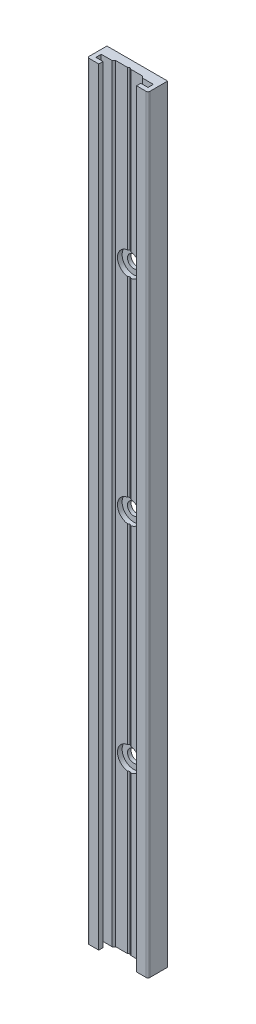
ISO-10303-21;
HEADER;
FILE_DESCRIPTION(('STEP AP214'),'2;1');
FILE_NAME('part.step','',(''),(''),'','','');
FILE_SCHEMA(('AUTOMOTIVE_DESIGN { 1 0 10303 214 1 1 1 1 }'));
ENDSEC;
DATA;
#1=APPLICATION_CONTEXT('core data for automotive mechanical design processes');
#2=APPLICATION_PROTOCOL_DEFINITION('international standard','automotive_design',2000,#1);
#3=PRODUCT_CONTEXT('',#1,'mechanical');
#4=PRODUCT('Part','Part','',(#3));
#5=PRODUCT_RELATED_PRODUCT_CATEGORY('part','',(#4));
#6=PRODUCT_DEFINITION_FORMATION('','',#4);
#7=PRODUCT_DEFINITION_CONTEXT('part definition',#1,'design');
#8=PRODUCT_DEFINITION('design','',#6,#7);
#9=PRODUCT_DEFINITION_SHAPE('','',#8);
#10=(LENGTH_UNIT() NAMED_UNIT(*) SI_UNIT(.MILLI.,.METRE.));
#11=(NAMED_UNIT(*) PLANE_ANGLE_UNIT() SI_UNIT($,.RADIAN.));
#12=(NAMED_UNIT(*) SI_UNIT($,.STERADIAN.) SOLID_ANGLE_UNIT());
#13=UNCERTAINTY_MEASURE_WITH_UNIT(LENGTH_MEASURE(1.E-05),#10,'distance_accuracy_value','');
#14=(GEOMETRIC_REPRESENTATION_CONTEXT(3) GLOBAL_UNCERTAINTY_ASSIGNED_CONTEXT((#13)) GLOBAL_UNIT_ASSIGNED_CONTEXT((#10,
#11,#12)) REPRESENTATION_CONTEXT('',''));
#15=CARTESIAN_POINT('',(0.,0.,0.));
#16=DIRECTION('',(0.,0.,1.));
#17=DIRECTION('',(1.,0.,0.));
#18=AXIS2_PLACEMENT_3D('',#15,#16,#17);
#19=CARTESIAN_POINT('',(8.,215.,5.));
#20=DIRECTION('',(0.,-1.,0.));
#21=DIRECTION('',(0.,0.,-1.));
#22=AXIS2_PLACEMENT_3D('',#19,#20,#21);
#23=CYLINDRICAL_SURFACE('',#22,0.500000000000005);
#24=CARTESIAN_POINT('',(8.,0.,5.));
#25=DIRECTION('',(0.,-1.,0.));
#26=DIRECTION('',(0.,0.,-1.));
#27=AXIS2_PLACEMENT_3D('',#24,#25,#26);
#28=CIRCLE('',#27,0.500000000000005);
#29=CARTESIAN_POINT('',(8.,0.,5.5));
#30=VERTEX_POINT('',#29);
#31=CARTESIAN_POINT('',(8.5,0.,5.));
#32=VERTEX_POINT('',#31);
#33=EDGE_CURVE('E466',#30,#32,#28,.F.);
#34=ORIENTED_EDGE('',*,*,#33,.T.);
#35=DIRECTION('',(0.,-1.,0.));
#36=VECTOR('',#35,1.);
#37=CARTESIAN_POINT('',(8.5,107.5,5.));
#38=LINE('',#37,#36);
#39=CARTESIAN_POINT('',(8.5,215.,5.));
#40=VERTEX_POINT('',#39);
#41=EDGE_CURVE('E393',#40,#32,#38,.T.);
#42=ORIENTED_EDGE('',*,*,#41,.F.);
#43=CARTESIAN_POINT('',(8.,215.,5.));
#44=DIRECTION('',(0.,-1.,0.));
#45=DIRECTION('',(0.,0.,-1.));
#46=AXIS2_PLACEMENT_3D('',#43,#44,#45);
#47=CIRCLE('',#46,0.500000000000005);
#48=CARTESIAN_POINT('',(8.,215.,5.5));
#49=VERTEX_POINT('',#48);
#50=EDGE_CURVE('E20',#40,#49,#47,.T.);
#51=ORIENTED_EDGE('',*,*,#50,.T.);
#52=DIRECTION('',(0.,1.,0.));
#53=VECTOR('',#52,1.);
#54=CARTESIAN_POINT('',(8.,107.5,5.5));
#55=LINE('',#54,#53);
#56=EDGE_CURVE('E386',#30,#49,#55,.T.);
#57=ORIENTED_EDGE('',*,*,#56,.F.);
#58=EDGE_LOOP('',(#34,#42,#51,#57));
#59=FACE_BOUND('',#58,.T.);
#60=ADVANCED_FACE('F16',(#59),#23,.T.);
#61=CARTESIAN_POINT('',(5.3,0.,4.3));
#62=DIRECTION('',(-1.,0.,0.));
#63=DIRECTION('',(0.,0.,1.));
#64=AXIS2_PLACEMENT_3D('',#61,#62,#63);
#65=PLANE('',#64);
#66=DIRECTION('',(0.,0.,1.));
#67=VECTOR('',#66,1.);
#68=CARTESIAN_POINT('',(5.3,0.,4.9));
#69=LINE('',#68,#67);
#70=CARTESIAN_POINT('',(5.3,0.,4.3));
#71=VERTEX_POINT('',#70);
#72=CARTESIAN_POINT('',(5.3,0.,5.5));
#73=VERTEX_POINT('',#72);
#74=EDGE_CURVE('E462',#71,#73,#69,.T.);
#75=ORIENTED_EDGE('',*,*,#74,.T.);
#76=DIRECTION('',(0.,-1.,0.));
#77=VECTOR('',#76,1.);
#78=CARTESIAN_POINT('',(5.3,107.5,5.5));
#79=LINE('',#78,#77);
#80=CARTESIAN_POINT('',(5.3,215.,5.5));
#81=VERTEX_POINT('',#80);
#82=EDGE_CURVE('E389',#81,#73,#79,.T.);
#83=ORIENTED_EDGE('',*,*,#82,.F.);
#84=DIRECTION('',(0.,0.,-1.));
#85=VECTOR('',#84,1.);
#86=CARTESIAN_POINT('',(5.3,215.,4.9));
#87=LINE('',#86,#85);
#88=CARTESIAN_POINT('',(5.3,215.,4.3));
#89=VERTEX_POINT('',#88);
#90=EDGE_CURVE('E153',#81,#89,#87,.T.);
#91=ORIENTED_EDGE('',*,*,#90,.T.);
#92=DIRECTION('',(0.,1.,0.));
#93=VECTOR('',#92,1.);
#94=CARTESIAN_POINT('',(5.3,107.5,4.3));
#95=LINE('',#94,#93);
#96=EDGE_CURVE('E383',#71,#89,#95,.T.);
#97=ORIENTED_EDGE('',*,*,#96,.F.);
#98=EDGE_LOOP('',(#75,#83,#91,#97));
#99=FACE_BOUND('',#98,.T.);
#100=ADVANCED_FACE('F636',(#99),#65,.T.);
#101=CARTESIAN_POINT('',(7.3,0.,2.8));
#102=DIRECTION('',(-1.,0.,0.));
#103=DIRECTION('',(0.,0.,1.));
#104=AXIS2_PLACEMENT_3D('',#101,#102,#103);
#105=PLANE('',#104);
#106=DIRECTION('',(0.,0.,1.));
#107=VECTOR('',#106,1.);
#108=CARTESIAN_POINT('',(7.3,0.,3.55));
#109=LINE('',#108,#107);
#110=CARTESIAN_POINT('',(7.3,0.,2.8));
#111=VERTEX_POINT('',#110);
#112=CARTESIAN_POINT('',(7.3,0.,4.3));
#113=VERTEX_POINT('',#112);
#114=EDGE_CURVE('E448',#111,#113,#109,.T.);
#115=ORIENTED_EDGE('',*,*,#114,.T.);
#116=DIRECTION('',(0.,-1.,0.));
#117=VECTOR('',#116,1.);
#118=CARTESIAN_POINT('',(7.3,107.5,4.3));
#119=LINE('',#118,#117);
#120=CARTESIAN_POINT('',(7.3,215.,4.3));
#121=VERTEX_POINT('',#120);
#122=EDGE_CURVE('E388',#121,#113,#119,.T.);
#123=ORIENTED_EDGE('',*,*,#122,.F.);
#124=DIRECTION('',(0.,0.,-1.));
#125=VECTOR('',#124,1.);
#126=CARTESIAN_POINT('',(7.3,215.,3.55));
#127=LINE('',#126,#125);
#128=CARTESIAN_POINT('',(7.3,215.,2.8));
#129=VERTEX_POINT('',#128);
#130=EDGE_CURVE('E457',#121,#129,#127,.T.);
#131=ORIENTED_EDGE('',*,*,#130,.T.);
#132=DIRECTION('',(0.,1.,0.));
#133=VECTOR('',#132,1.);
#134=CARTESIAN_POINT('',(7.3,107.5,2.8));
#135=LINE('',#134,#133);
#136=EDGE_CURVE('E378',#111,#129,#135,.T.);
#137=ORIENTED_EDGE('',*,*,#136,.F.);
#138=EDGE_LOOP('',(#115,#123,#131,#137));
#139=FACE_BOUND('',#138,.T.);
#140=ADVANCED_FACE('F642',(#139),#105,.T.);
#141=CARTESIAN_POINT('',(-7.3,0.,4.3));
#142=DIRECTION('',(1.,0.,0.));
#143=DIRECTION('',(0.,0.,-1.));
#144=AXIS2_PLACEMENT_3D('',#141,#142,#143);
#145=PLANE('',#144);
#146=DIRECTION('',(0.,0.,-1.));
#147=VECTOR('',#146,1.);
#148=CARTESIAN_POINT('',(-7.3,0.,3.55));
#149=LINE('',#148,#147);
#150=CARTESIAN_POINT('',(-7.3,0.,4.3));
#151=VERTEX_POINT('',#150);
#152=CARTESIAN_POINT('',(-7.3,0.,2.8));
#153=VERTEX_POINT('',#152);
#154=EDGE_CURVE('E442',#151,#153,#149,.T.);
#155=ORIENTED_EDGE('',*,*,#154,.T.);
#156=DIRECTION('',(0.,-1.,0.));
#157=VECTOR('',#156,1.);
#158=CARTESIAN_POINT('',(-7.3,107.5,2.8));
#159=LINE('',#158,#157);
#160=CARTESIAN_POINT('',(-7.3,215.,2.8));
#161=VERTEX_POINT('',#160);
#162=EDGE_CURVE('E382',#161,#153,#159,.T.);
#163=ORIENTED_EDGE('',*,*,#162,.F.);
#164=DIRECTION('',(0.,0.,1.));
#165=VECTOR('',#164,1.);
#166=CARTESIAN_POINT('',(-7.3,215.,3.55));
#167=LINE('',#166,#165);
#168=CARTESIAN_POINT('',(-7.3,215.,4.3));
#169=VERTEX_POINT('',#168);
#170=EDGE_CURVE('E445',#161,#169,#167,.T.);
#171=ORIENTED_EDGE('',*,*,#170,.T.);
#172=DIRECTION('',(0.,1.,0.));
#173=VECTOR('',#172,1.);
#174=CARTESIAN_POINT('',(-7.3,107.5,4.3));
#175=LINE('',#174,#173);
#176=EDGE_CURVE('E351',#151,#169,#175,.T.);
#177=ORIENTED_EDGE('',*,*,#176,.F.);
#178=EDGE_LOOP('',(#155,#163,#171,#177));
#179=FACE_BOUND('',#178,.T.);
#180=ADVANCED_FACE('F679',(#179),#145,.T.);
#181=CARTESIAN_POINT('',(-5.3,0.,5.5));
#182=DIRECTION('',(1.,0.,0.));
#183=DIRECTION('',(0.,0.,-1.));
#184=AXIS2_PLACEMENT_3D('',#181,#182,#183);
#185=PLANE('',#184);
#186=DIRECTION('',(0.,0.,-1.));
#187=VECTOR('',#186,1.);
#188=CARTESIAN_POINT('',(-5.3,0.,4.9));
#189=LINE('',#188,#187);
#190=CARTESIAN_POINT('',(-5.3,0.,5.5));
#191=VERTEX_POINT('',#190);
#192=CARTESIAN_POINT('',(-5.3,0.,4.3));
#193=VERTEX_POINT('',#192);
#194=EDGE_CURVE('E433',#191,#193,#189,.T.);
#195=ORIENTED_EDGE('',*,*,#194,.T.);
#196=DIRECTION('',(0.,-1.,0.));
#197=VECTOR('',#196,1.);
#198=CARTESIAN_POINT('',(-5.3,107.5,4.3));
#199=LINE('',#198,#197);
#200=CARTESIAN_POINT('',(-5.3,215.,4.3));
#201=VERTEX_POINT('',#200);
#202=EDGE_CURVE('E430',#201,#193,#199,.T.);
#203=ORIENTED_EDGE('',*,*,#202,.F.);
#204=DIRECTION('',(0.,0.,1.));
#205=VECTOR('',#204,1.);
#206=CARTESIAN_POINT('',(-5.3,215.,4.9));
#207=LINE('',#206,#205);
#208=CARTESIAN_POINT('',(-5.3,215.,5.5));
#209=VERTEX_POINT('',#208);
#210=EDGE_CURVE('E437',#201,#209,#207,.T.);
#211=ORIENTED_EDGE('',*,*,#210,.T.);
#212=DIRECTION('',(0.,1.,0.));
#213=VECTOR('',#212,1.);
#214=CARTESIAN_POINT('',(-5.3,107.5,5.5));
#215=LINE('',#214,#213);
#216=EDGE_CURVE('E343',#191,#209,#215,.T.);
#217=ORIENTED_EDGE('',*,*,#216,.F.);
#218=EDGE_LOOP('',(#195,#203,#211,#217));
#219=FACE_BOUND('',#218,.T.);
#220=ADVANCED_FACE('F688',(#219),#185,.T.);
#221=CARTESIAN_POINT('',(-8.,215.,5.));
#222=DIRECTION('',(0.,-1.,0.));
#223=DIRECTION('',(0.,0.,-1.));
#224=AXIS2_PLACEMENT_3D('',#221,#222,#223);
#225=CYLINDRICAL_SURFACE('',#224,0.5);
#226=CARTESIAN_POINT('',(-8.,0.,5.));
#227=DIRECTION('',(0.,-1.,0.));
#228=DIRECTION('',(0.,0.,-1.));
#229=AXIS2_PLACEMENT_3D('',#226,#227,#228);
#230=CIRCLE('',#229,0.5);
#231=CARTESIAN_POINT('',(-8.5,0.,5.));
#232=VERTEX_POINT('',#231);
#233=CARTESIAN_POINT('',(-8.,0.,5.5));
#234=VERTEX_POINT('',#233);
#235=EDGE_CURVE('E585',#232,#234,#230,.F.);
#236=ORIENTED_EDGE('',*,*,#235,.T.);
#237=DIRECTION('',(0.,-1.,0.));
#238=VECTOR('',#237,1.);
#239=CARTESIAN_POINT('',(-8.,107.5,5.5));
#240=LINE('',#239,#238);
#241=CARTESIAN_POINT('',(-8.,215.,5.5));
#242=VERTEX_POINT('',#241);
#243=EDGE_CURVE('E348',#242,#234,#240,.T.);
#244=ORIENTED_EDGE('',*,*,#243,.F.);
#245=CARTESIAN_POINT('',(-8.,215.,5.));
#246=DIRECTION('',(0.,-1.,0.));
#247=DIRECTION('',(0.,0.,-1.));
#248=AXIS2_PLACEMENT_3D('',#245,#246,#247);
#249=CIRCLE('',#248,0.5);
#250=CARTESIAN_POINT('',(-8.5,215.,5.));
#251=VERTEX_POINT('',#250);
#252=EDGE_CURVE('E436',#242,#251,#249,.T.);
#253=ORIENTED_EDGE('',*,*,#252,.T.);
#254=DIRECTION('',(0.,1.,0.));
#255=VECTOR('',#254,1.);
#256=CARTESIAN_POINT('',(-8.5,107.5,5.));
#257=LINE('',#256,#255);
#258=EDGE_CURVE('E339',#232,#251,#257,.T.);
#259=ORIENTED_EDGE('',*,*,#258,.F.);
#260=EDGE_LOOP('',(#236,#244,#253,#259));
#261=FACE_BOUND('',#260,.T.);
#262=ADVANCED_FACE('F696',(#261),#225,.T.);
#263=CARTESIAN_POINT('',(0.,167.5,0.));
#264=DIRECTION('',(0.,0.,1.));
#265=DIRECTION('',(1.,0.,0.));
#266=AXIS2_PLACEMENT_3D('',#263,#264,#265);
#267=CYLINDRICAL_SURFACE('',#266,1.75);
#268=CARTESIAN_POINT('',(0.,167.5,0.));
#269=DIRECTION('',(0.,0.,1.));
#270=DIRECTION('',(1.,0.,0.));
#271=AXIS2_PLACEMENT_3D('',#268,#269,#270);
#272=CIRCLE('',#271,1.75);
#273=CARTESIAN_POINT('',(1.75,167.5,0.));
#274=VERTEX_POINT('',#273);
#275=EDGE_CURVE('E403',#274,#274,#272,.T.);
#276=ORIENTED_EDGE('',*,*,#275,.F.);
#277=EDGE_LOOP('',(#276));
#278=FACE_BOUND('',#277,.T.);
#279=CARTESIAN_POINT('',(0.,167.5,1.));
#280=DIRECTION('',(0.,0.,1.));
#281=DIRECTION('',(1.,0.,0.));
#282=AXIS2_PLACEMENT_3D('',#279,#280,#281);
#283=CIRCLE('',#282,1.75);
#284=CARTESIAN_POINT('',(1.75,167.5,1.));
#285=VERTEX_POINT('',#284);
#286=EDGE_CURVE('E398',#285,#285,#283,.F.);
#287=ORIENTED_EDGE('',*,*,#286,.F.);
#288=EDGE_LOOP('',(#287));
#289=FACE_BOUND('',#288,.T.);
#290=ADVANCED_FACE('F996',(#278,#289),#267,.F.);
#291=CARTESIAN_POINT('',(0.,107.5,0.));
#292=DIRECTION('',(0.,0.,1.));
#293=DIRECTION('',(1.,0.,0.));
#294=AXIS2_PLACEMENT_3D('',#291,#292,#293);
#295=CYLINDRICAL_SURFACE('',#294,1.75);
#296=CARTESIAN_POINT('',(0.,107.5,0.));
#297=DIRECTION('',(0.,0.,1.));
#298=DIRECTION('',(1.,0.,0.));
#299=AXIS2_PLACEMENT_3D('',#296,#297,#298);
#300=CIRCLE('',#299,1.75);
#301=CARTESIAN_POINT('',(1.75,107.5,0.));
#302=VERTEX_POINT('',#301);
#303=EDGE_CURVE('E572',#302,#302,#300,.T.);
#304=ORIENTED_EDGE('',*,*,#303,.F.);
#305=EDGE_LOOP('',(#304));
#306=FACE_BOUND('',#305,.T.);
#307=CARTESIAN_POINT('',(0.,107.5,1.));
#308=DIRECTION('',(0.,0.,1.));
#309=DIRECTION('',(1.,0.,0.));
#310=AXIS2_PLACEMENT_3D('',#307,#308,#309);
#311=CIRCLE('',#310,1.75);
#312=CARTESIAN_POINT('',(1.75,107.5,1.));
#313=VERTEX_POINT('',#312);
#314=EDGE_CURVE('E342',#313,#313,#311,.F.);
#315=ORIENTED_EDGE('',*,*,#314,.F.);
#316=EDGE_LOOP('',(#315));
#317=FACE_BOUND('',#316,.T.);
#318=ADVANCED_FACE('F986',(#306,#317),#295,.F.);
#319=CARTESIAN_POINT('',(-3.25,164.25,1.));
#320=DIRECTION('',(0.,0.,1.));
#321=DIRECTION('',(1.,0.,0.));
#322=AXIS2_PLACEMENT_3D('',#319,#320,#321);
#323=PLANE('',#322);
#324=ORIENTED_EDGE('',*,*,#286,.T.);
#325=EDGE_LOOP('',(#324));
#326=FACE_BOUND('',#325,.T.);
#327=CARTESIAN_POINT('',(0.,167.5,1.));
#328=DIRECTION('',(0.,0.,1.));
#329=DIRECTION('',(1.,0.,0.));
#330=AXIS2_PLACEMENT_3D('',#327,#328,#329);
#331=CIRCLE('',#330,3.25);
#332=CARTESIAN_POINT('',(3.25,167.5,1.));
#333=VERTEX_POINT('',#332);
#334=EDGE_CURVE('E562',#333,#333,#331,.F.);
#335=ORIENTED_EDGE('',*,*,#334,.F.);
#336=EDGE_LOOP('',(#335));
#337=FACE_BOUND('',#336,.T.);
#338=ADVANCED_FACE('F978',(#326,#337),#323,.T.);
#339=CARTESIAN_POINT('',(8.5,0.,5.));
#340=DIRECTION('',(1.,0.,0.));
#341=DIRECTION('',(0.,0.,-1.));
#342=AXIS2_PLACEMENT_3D('',#339,#340,#341);
#343=PLANE('',#342);
#344=DIRECTION('',(0.,0.,1.));
#345=VECTOR('',#344,1.);
#346=CARTESIAN_POINT('',(8.5,0.,2.75));
#347=LINE('',#346,#345);
#348=CARTESIAN_POINT('',(8.5,0.,0.));
#349=VERTEX_POINT('',#348);
#350=EDGE_CURVE('E284',#349,#32,#347,.T.);
#351=ORIENTED_EDGE('',*,*,#350,.F.);
#352=DIRECTION('',(0.,-1.,0.));
#353=VECTOR('',#352,1.);
#354=CARTESIAN_POINT('',(8.5,107.5,0.));
#355=LINE('',#354,#353);
#356=CARTESIAN_POINT('',(8.5,215.,0.));
#357=VERTEX_POINT('',#356);
#358=EDGE_CURVE('E404',#357,#349,#355,.T.);
#359=ORIENTED_EDGE('',*,*,#358,.F.);
#360=DIRECTION('',(0.,0.,-1.));
#361=VECTOR('',#360,1.);
#362=CARTESIAN_POINT('',(8.5,215.,2.75));
#363=LINE('',#362,#361);
#364=EDGE_CURVE('E300',#40,#357,#363,.T.);
#365=ORIENTED_EDGE('',*,*,#364,.F.);
#366=ORIENTED_EDGE('',*,*,#41,.T.);
#367=EDGE_LOOP('',(#351,#359,#365,#366));
#368=FACE_BOUND('',#367,.T.);
#369=ADVANCED_FACE('F592',(#368),#343,.T.);
#370=CARTESIAN_POINT('',(5.3,0.,5.5));
#371=DIRECTION('',(0.,0.,1.));
#372=DIRECTION('',(1.,0.,0.));
#373=AXIS2_PLACEMENT_3D('',#370,#371,#372);
#374=PLANE('',#373);
#375=DIRECTION('',(-1.,0.,0.));
#376=VECTOR('',#375,1.);
#377=CARTESIAN_POINT('',(0.,0.,5.5));
#378=LINE('',#377,#376);
#379=EDGE_CURVE('E280',#30,#73,#378,.T.);
#380=ORIENTED_EDGE('',*,*,#379,.F.);
#381=ORIENTED_EDGE('',*,*,#56,.T.);
#382=DIRECTION('',(1.,0.,0.));
#383=VECTOR('',#382,1.);
#384=CARTESIAN_POINT('',(0.,215.,5.5));
#385=LINE('',#384,#383);
#386=EDGE_CURVE('E308',#81,#49,#385,.T.);
#387=ORIENTED_EDGE('',*,*,#386,.F.);
#388=ORIENTED_EDGE('',*,*,#82,.T.);
#389=EDGE_LOOP('',(#380,#381,#387,#388));
#390=FACE_BOUND('',#389,.T.);
#391=ADVANCED_FACE('F960',(#390),#374,.T.);
#392=CARTESIAN_POINT('',(7.3,0.,4.3));
#393=DIRECTION('',(0.,0.,-1.));
#394=DIRECTION('',(-1.,0.,0.));
#395=AXIS2_PLACEMENT_3D('',#392,#393,#394);
#396=PLANE('',#395);
#397=DIRECTION('',(1.,0.,0.));
#398=VECTOR('',#397,1.);
#399=CARTESIAN_POINT('',(0.,0.,4.3));
#400=LINE('',#399,#398);
#401=EDGE_CURVE('E283',#71,#113,#400,.T.);
#402=ORIENTED_EDGE('',*,*,#401,.F.);
#403=ORIENTED_EDGE('',*,*,#96,.T.);
#404=DIRECTION('',(-1.,0.,0.));
#405=VECTOR('',#404,1.);
#406=CARTESIAN_POINT('',(0.,215.,4.3));
#407=LINE('',#406,#405);
#408=EDGE_CURVE('E312',#121,#89,#407,.T.);
#409=ORIENTED_EDGE('',*,*,#408,.F.);
#410=ORIENTED_EDGE('',*,*,#122,.T.);
#411=EDGE_LOOP('',(#402,#403,#409,#410));
#412=FACE_BOUND('',#411,.T.);
#413=ADVANCED_FACE('F639',(#412),#396,.T.);
#414=CARTESIAN_POINT('',(4.25,0.,2.8));
#415=DIRECTION('',(0.,0.,1.));
#416=DIRECTION('',(1.,0.,0.));
#417=AXIS2_PLACEMENT_3D('',#414,#415,#416);
#418=PLANE('',#417);
#419=DIRECTION('',(-1.,0.,0.));
#420=VECTOR('',#419,1.);
#421=CARTESIAN_POINT('',(0.,0.,2.8));
#422=LINE('',#421,#420);
#423=CARTESIAN_POINT('',(4.25,0.,2.8));
#424=VERTEX_POINT('',#423);
#425=EDGE_CURVE('E372',#111,#424,#422,.T.);
#426=ORIENTED_EDGE('',*,*,#425,.F.);
#427=ORIENTED_EDGE('',*,*,#136,.T.);
#428=DIRECTION('',(1.,0.,0.));
#429=VECTOR('',#428,1.);
#430=CARTESIAN_POINT('',(0.,215.,2.8));
#431=LINE('',#430,#429);
#432=CARTESIAN_POINT('',(4.25,215.,2.8));
#433=VERTEX_POINT('',#432);
#434=EDGE_CURVE('E421',#433,#129,#431,.T.);
#435=ORIENTED_EDGE('',*,*,#434,.F.);
#436=DIRECTION('',(0.,1.,0.));
#437=VECTOR('',#436,1.);
#438=CARTESIAN_POINT('',(4.25,107.5,2.8));
#439=LINE('',#438,#437);
#440=EDGE_CURVE('E367',#424,#433,#439,.T.);
#441=ORIENTED_EDGE('',*,*,#440,.F.);
#442=EDGE_LOOP('',(#426,#427,#435,#441));
#443=FACE_BOUND('',#442,.T.);
#444=ADVANCED_FACE('F649',(#443),#418,.T.);
#445=CARTESIAN_POINT('',(-7.3,0.,2.8));
#446=DIRECTION('',(0.,0.,1.));
#447=DIRECTION('',(1.,0.,0.));
#448=AXIS2_PLACEMENT_3D('',#445,#446,#447);
#449=PLANE('',#448);
#450=DIRECTION('',(-1.,0.,0.));
#451=VECTOR('',#450,1.);
#452=CARTESIAN_POINT('',(0.,0.,2.8));
#453=LINE('',#452,#451);
#454=CARTESIAN_POINT('',(-4.25,0.,2.8));
#455=VERTEX_POINT('',#454);
#456=EDGE_CURVE('E361',#455,#153,#453,.T.);
#457=ORIENTED_EDGE('',*,*,#456,.F.);
#458=DIRECTION('',(0.,-1.,0.));
#459=VECTOR('',#458,1.);
#460=CARTESIAN_POINT('',(-4.25,107.5,2.8));
#461=LINE('',#460,#459);
#462=CARTESIAN_POINT('',(-4.25,215.,2.8));
#463=VERTEX_POINT('',#462);
#464=EDGE_CURVE('E299',#463,#455,#461,.T.);
#465=ORIENTED_EDGE('',*,*,#464,.F.);
#466=DIRECTION('',(1.,0.,0.));
#467=VECTOR('',#466,1.);
#468=CARTESIAN_POINT('',(0.,215.,2.8));
#469=LINE('',#468,#467);
#470=EDGE_CURVE('E412',#161,#463,#469,.T.);
#471=ORIENTED_EDGE('',*,*,#470,.F.);
#472=ORIENTED_EDGE('',*,*,#162,.T.);
#473=EDGE_LOOP('',(#457,#465,#471,#472));
#474=FACE_BOUND('',#473,.T.);
#475=ADVANCED_FACE('F676',(#474),#449,.T.);
#476=CARTESIAN_POINT('',(-5.3,0.,4.3));
#477=DIRECTION('',(0.,0.,-1.));
#478=DIRECTION('',(-1.,0.,0.));
#479=AXIS2_PLACEMENT_3D('',#476,#477,#478);
#480=PLANE('',#479);
#481=DIRECTION('',(1.,0.,0.));
#482=VECTOR('',#481,1.);
#483=CARTESIAN_POINT('',(0.,0.,4.3));
#484=LINE('',#483,#482);
#485=EDGE_CURVE('E277',#151,#193,#484,.T.);
#486=ORIENTED_EDGE('',*,*,#485,.F.);
#487=ORIENTED_EDGE('',*,*,#176,.T.);
#488=DIRECTION('',(-1.,0.,0.));
#489=VECTOR('',#488,1.);
#490=CARTESIAN_POINT('',(0.,215.,4.3));
#491=LINE('',#490,#489);
#492=EDGE_CURVE('E318',#201,#169,#491,.T.);
#493=ORIENTED_EDGE('',*,*,#492,.F.);
#494=ORIENTED_EDGE('',*,*,#202,.T.);
#495=EDGE_LOOP('',(#486,#487,#493,#494));
#496=FACE_BOUND('',#495,.T.);
#497=ADVANCED_FACE('F684',(#496),#480,.T.);
#498=CARTESIAN_POINT('',(-8.,0.,5.5));
#499=DIRECTION('',(0.,0.,1.));
#500=DIRECTION('',(1.,0.,0.));
#501=AXIS2_PLACEMENT_3D('',#498,#499,#500);
#502=PLANE('',#501);
#503=DIRECTION('',(-1.,0.,0.));
#504=VECTOR('',#503,1.);
#505=CARTESIAN_POINT('',(0.,0.,5.5));
#506=LINE('',#505,#504);
#507=EDGE_CURVE('E272',#191,#234,#506,.T.);
#508=ORIENTED_EDGE('',*,*,#507,.F.);
#509=ORIENTED_EDGE('',*,*,#216,.T.);
#510=DIRECTION('',(1.,0.,0.));
#511=VECTOR('',#510,1.);
#512=CARTESIAN_POINT('',(0.,215.,5.5));
#513=LINE('',#512,#511);
#514=EDGE_CURVE('E315',#242,#209,#513,.T.);
#515=ORIENTED_EDGE('',*,*,#514,.F.);
#516=ORIENTED_EDGE('',*,*,#243,.T.);
#517=EDGE_LOOP('',(#508,#509,#515,#516));
#518=FACE_BOUND('',#517,.T.);
#519=ADVANCED_FACE('F692',(#518),#502,.T.);
#520=CARTESIAN_POINT('',(-8.5,0.,0.));
#521=DIRECTION('',(-1.,0.,0.));
#522=DIRECTION('',(0.,0.,1.));
#523=AXIS2_PLACEMENT_3D('',#520,#521,#522);
#524=PLANE('',#523);
#525=DIRECTION('',(0.,0.,-1.));
#526=VECTOR('',#525,1.);
#527=CARTESIAN_POINT('',(-8.5,0.,2.75));
#528=LINE('',#527,#526);
#529=CARTESIAN_POINT('',(-8.5,0.,0.));
#530=VERTEX_POINT('',#529);
#531=EDGE_CURVE('E262',#232,#530,#528,.T.);
#532=ORIENTED_EDGE('',*,*,#531,.F.);
#533=ORIENTED_EDGE('',*,*,#258,.T.);
#534=DIRECTION('',(0.,0.,1.));
#535=VECTOR('',#534,1.);
#536=CARTESIAN_POINT('',(-8.5,215.,2.75));
#537=LINE('',#536,#535);
#538=CARTESIAN_POINT('',(-8.5,215.,0.));
#539=VERTEX_POINT('',#538);
#540=EDGE_CURVE('E319',#539,#251,#537,.T.);
#541=ORIENTED_EDGE('',*,*,#540,.F.);
#542=DIRECTION('',(0.,1.,0.));
#543=VECTOR('',#542,1.);
#544=CARTESIAN_POINT('',(-8.5,107.5,0.));
#545=LINE('',#544,#543);
#546=EDGE_CURVE('E399',#530,#539,#545,.T.);
#547=ORIENTED_EDGE('',*,*,#546,.F.);
#548=EDGE_LOOP('',(#532,#533,#541,#547));
#549=FACE_BOUND('',#548,.T.);
#550=ADVANCED_FACE('F697',(#549),#524,.T.);
#551=CARTESIAN_POINT('',(-3.25,104.25,1.));
#552=DIRECTION('',(0.,0.,1.));
#553=DIRECTION('',(1.,0.,0.));
#554=AXIS2_PLACEMENT_3D('',#551,#552,#553);
#555=PLANE('',#554);
#556=ORIENTED_EDGE('',*,*,#314,.T.);
#557=EDGE_LOOP('',(#556));
#558=FACE_BOUND('',#557,.T.);
#559=CARTESIAN_POINT('',(0.,107.5,1.));
#560=DIRECTION('',(0.,0.,1.));
#561=DIRECTION('',(1.,0.,0.));
#562=AXIS2_PLACEMENT_3D('',#559,#560,#561);
#563=CIRCLE('',#562,3.25);
#564=CARTESIAN_POINT('',(3.25,107.5,1.));
#565=VERTEX_POINT('',#564);
#566=EDGE_CURVE('E538',#565,#565,#563,.F.);
#567=ORIENTED_EDGE('',*,*,#566,.F.);
#568=EDGE_LOOP('',(#567));
#569=FACE_BOUND('',#568,.T.);
#570=ADVANCED_FACE('F699',(#558,#569),#555,.T.);
#571=CARTESIAN_POINT('',(8.5,0.,0.));
#572=DIRECTION('',(0.,0.,-1.));
#573=DIRECTION('',(-1.,0.,0.));
#574=AXIS2_PLACEMENT_3D('',#571,#572,#573);
#575=PLANE('',#574);
#576=CARTESIAN_POINT('',(0.,47.5,0.));
#577=DIRECTION('',(0.,0.,1.));
#578=DIRECTION('',(1.,0.,0.));
#579=AXIS2_PLACEMENT_3D('',#576,#577,#578);
#580=CIRCLE('',#579,1.75);
#581=CARTESIAN_POINT('',(1.75000000000001,47.5,0.));
#582=VERTEX_POINT('',#581);
#583=EDGE_CURVE('E524',#582,#582,#580,.F.);
#584=ORIENTED_EDGE('',*,*,#583,.F.);
#585=EDGE_LOOP('',(#584));
#586=FACE_BOUND('',#585,.T.);
#587=ORIENTED_EDGE('',*,*,#303,.T.);
#588=EDGE_LOOP('',(#587));
#589=FACE_BOUND('',#588,.T.);
#590=ORIENTED_EDGE('',*,*,#275,.T.);
#591=EDGE_LOOP('',(#590));
#592=FACE_BOUND('',#591,.T.);
#593=DIRECTION('',(1.,0.,0.));
#594=VECTOR('',#593,1.);
#595=CARTESIAN_POINT('',(0.,0.,0.));
#596=LINE('',#595,#594);
#597=EDGE_CURVE('E289',#530,#349,#596,.T.);
#598=ORIENTED_EDGE('',*,*,#597,.F.);
#599=ORIENTED_EDGE('',*,*,#546,.T.);
#600=DIRECTION('',(-1.,0.,0.));
#601=VECTOR('',#600,1.);
#602=CARTESIAN_POINT('',(0.,215.,0.));
#603=LINE('',#602,#601);
#604=EDGE_CURVE('E324',#357,#539,#603,.T.);
#605=ORIENTED_EDGE('',*,*,#604,.F.);
#606=ORIENTED_EDGE('',*,*,#358,.T.);
#607=EDGE_LOOP('',(#598,#599,#605,#606));
#608=FACE_BOUND('',#607,.T.);
#609=ADVANCED_FACE('F599',(#586,#589,#592,#608),#575,.T.);
#610=CARTESIAN_POINT('',(0.,110.711308144666,2.01132487));
#611=DIRECTION('',(-0.499999994031163,0.,0.866025407230548));
#612=DIRECTION('',(0.866025407230548,0.,0.499999994031163));
#613=AXIS2_PLACEMENT_3D('',#610,#611,#612);
#614=PLANE('',#613);
#615=CARTESIAN_POINT('',(0.,107.5,2.01132487));
#616=DIRECTION('',(-0.499999994031163,0.,0.866025407230548));
#617=DIRECTION('',(0.866025407230548,0.,0.499999994031163));
#618=AXIS2_PLACEMENT_3D('',#615,#616,#617);
#619=ELLIPSE('',#618,3.75277673479943,3.25);
#620=CARTESIAN_POINT('',(0.5,110.711308144666,2.3));
#621=VERTEX_POINT('',#620);
#622=CARTESIAN_POINT('',(0.,110.75,2.01132487));
#623=VERTEX_POINT('',#622);
#624=EDGE_CURVE('E542',#621,#623,#619,.T.);
#625=ORIENTED_EDGE('',*,*,#624,.F.);
#626=DIRECTION('',(0.,-1.,0.));
#627=VECTOR('',#626,1.);
#628=CARTESIAN_POINT('',(0.5,107.5,2.3));
#629=LINE('',#628,#627);
#630=CARTESIAN_POINT('',(0.5,164.288691855334,2.3));
#631=VERTEX_POINT('',#630);
#632=EDGE_CURVE('E245',#631,#621,#629,.T.);
#633=ORIENTED_EDGE('',*,*,#632,.F.);
#634=CARTESIAN_POINT('',(0.,167.5,2.01132487));
#635=DIRECTION('',(-0.499999994031163,0.,0.866025407230548));
#636=DIRECTION('',(0.866025407230548,0.,0.499999994031163));
#637=AXIS2_PLACEMENT_3D('',#634,#635,#636);
#638=ELLIPSE('',#637,3.75277673479943,3.25);
#639=CARTESIAN_POINT('',(0.,164.25,2.01132487));
#640=VERTEX_POINT('',#639);
#641=EDGE_CURVE('E370',#640,#631,#638,.T.);
#642=ORIENTED_EDGE('',*,*,#641,.F.);
#643=DIRECTION('',(0.,1.,0.));
#644=VECTOR('',#643,1.);
#645=CARTESIAN_POINT('',(0.,137.5,2.01132487));
#646=LINE('',#645,#644);
#647=EDGE_CURVE('E250',#623,#640,#646,.T.);
#648=ORIENTED_EDGE('',*,*,#647,.F.);
#649=EDGE_LOOP('',(#625,#633,#642,#648));
#650=FACE_BOUND('',#649,.T.);
#651=ADVANCED_FACE('F725',(#650),#614,.T.);
#652=CARTESIAN_POINT('',(0.,50.7113081446663,2.01132487));
#653=DIRECTION('',(-0.499999994031163,0.,0.866025407230548));
#654=DIRECTION('',(0.866025407230548,0.,0.499999994031163));
#655=AXIS2_PLACEMENT_3D('',#652,#653,#654);
#656=PLANE('',#655);
#657=CARTESIAN_POINT('',(0.,47.5,2.01132487));
#658=DIRECTION('',(-0.499999994031163,0.,0.866025407230548));
#659=DIRECTION('',(0.866025407230548,0.,0.499999994031163));
#660=AXIS2_PLACEMENT_3D('',#657,#658,#659);
#661=ELLIPSE('',#660,3.75277673479943,3.25);
#662=CARTESIAN_POINT('',(0.,50.75,2.01132487));
#663=VERTEX_POINT('',#662);
#664=CARTESIAN_POINT('',(0.5,50.7113081446663,2.3));
#665=VERTEX_POINT('',#664);
#666=EDGE_CURVE('E371',#663,#665,#661,.F.);
#667=ORIENTED_EDGE('',*,*,#666,.T.);
#668=DIRECTION('',(0.,-1.,0.));
#669=VECTOR('',#668,1.);
#670=CARTESIAN_POINT('',(0.5,107.5,2.3));
#671=LINE('',#670,#669);
#672=CARTESIAN_POINT('',(0.5,104.288691855334,2.3));
#673=VERTEX_POINT('',#672);
#674=EDGE_CURVE('E240',#673,#665,#671,.T.);
#675=ORIENTED_EDGE('',*,*,#674,.F.);
#676=CARTESIAN_POINT('',(0.,107.5,2.01132487));
#677=DIRECTION('',(-0.499999994031163,0.,0.866025407230548));
#678=DIRECTION('',(0.866025407230548,0.,0.499999994031163));
#679=AXIS2_PLACEMENT_3D('',#676,#677,#678);
#680=ELLIPSE('',#679,3.75277673479943,3.25);
#681=CARTESIAN_POINT('',(0.,104.25,2.01132487));
#682=VERTEX_POINT('',#681);
#683=EDGE_CURVE('E210',#682,#673,#680,.T.);
#684=ORIENTED_EDGE('',*,*,#683,.F.);
#685=DIRECTION('',(0.,1.,0.));
#686=VECTOR('',#685,1.);
#687=CARTESIAN_POINT('',(0.,77.5,2.01132487));
#688=LINE('',#687,#686);
#689=EDGE_CURVE('E207',#663,#682,#688,.T.);
#690=ORIENTED_EDGE('',*,*,#689,.F.);
#691=EDGE_LOOP('',(#667,#675,#684,#690));
#692=FACE_BOUND('',#691,.T.);
#693=ADVANCED_FACE('F719',(#692),#656,.T.);
#694=CARTESIAN_POINT('',(0.,0.,2.01132487));
#695=DIRECTION('',(-0.499999994031163,0.,0.866025407230548));
#696=DIRECTION('',(0.866025407230548,0.,0.499999994031163));
#697=AXIS2_PLACEMENT_3D('',#694,#695,#696);
#698=PLANE('',#697);
#699=DIRECTION('',(-0.866025407230549,0.,-0.499999994031162));
#700=VECTOR('',#699,1.);
#701=CARTESIAN_POINT('',(0.5,0.,2.3));
#702=LINE('',#701,#700);
#703=CARTESIAN_POINT('',(0.500000000000001,0.,2.3));
#704=VERTEX_POINT('',#703);
#705=CARTESIAN_POINT('',(0.,0.,2.01132487));
#706=VERTEX_POINT('',#705);
#707=EDGE_CURVE('E550',#704,#706,#702,.T.);
#708=ORIENTED_EDGE('',*,*,#707,.F.);
#709=DIRECTION('',(0.,-1.,0.));
#710=VECTOR('',#709,1.);
#711=CARTESIAN_POINT('',(0.5,107.5,2.3));
#712=LINE('',#711,#710);
#713=CARTESIAN_POINT('',(0.5,44.2886918553337,2.3));
#714=VERTEX_POINT('',#713);
#715=EDGE_CURVE('E236',#714,#704,#712,.T.);
#716=ORIENTED_EDGE('',*,*,#715,.F.);
#717=CARTESIAN_POINT('',(0.,47.5,2.01132487));
#718=DIRECTION('',(-0.499999994031163,0.,0.866025407230548));
#719=DIRECTION('',(0.866025407230548,0.,0.499999994031163));
#720=AXIS2_PLACEMENT_3D('',#717,#718,#719);
#721=ELLIPSE('',#720,3.75277673479943,3.25);
#722=CARTESIAN_POINT('',(0.,44.25,2.01132487));
#723=VERTEX_POINT('',#722);
#724=EDGE_CURVE('E527',#723,#714,#721,.T.);
#725=ORIENTED_EDGE('',*,*,#724,.F.);
#726=DIRECTION('',(0.,1.,0.));
#727=VECTOR('',#726,1.);
#728=CARTESIAN_POINT('',(0.,22.1443459276669,2.01132487));
#729=LINE('',#728,#727);
#730=EDGE_CURVE('E257',#706,#723,#729,.T.);
#731=ORIENTED_EDGE('',*,*,#730,.F.);
#732=EDGE_LOOP('',(#708,#716,#725,#731));
#733=FACE_BOUND('',#732,.T.);
#734=ADVANCED_FACE('F663',(#733),#698,.T.);
#735=CARTESIAN_POINT('',(3.75,0.,2.3));
#736=DIRECTION('',(-0.707106781186547,0.,0.707106781186548));
#737=DIRECTION('',(0.707106781186548,0.,0.707106781186547));
#738=AXIS2_PLACEMENT_3D('',#735,#736,#737);
#739=PLANE('',#738);
#740=DIRECTION('',(-0.707106781186548,0.,-0.707106781186547));
#741=VECTOR('',#740,1.);
#742=CARTESIAN_POINT('',(4.25,0.,2.8));
#743=LINE('',#742,#741);
#744=CARTESIAN_POINT('',(3.75,0.,2.3));
#745=VERTEX_POINT('',#744);
#746=EDGE_CURVE('E375',#424,#745,#743,.T.);
#747=ORIENTED_EDGE('',*,*,#746,.F.);
#748=ORIENTED_EDGE('',*,*,#440,.T.);
#749=DIRECTION('',(0.707106781186548,0.,0.707106781186547));
#750=VECTOR('',#749,1.);
#751=CARTESIAN_POINT('',(3.75,215.,2.3));
#752=LINE('',#751,#750);
#753=CARTESIAN_POINT('',(3.75,215.,2.3));
#754=VERTEX_POINT('',#753);
#755=EDGE_CURVE('E424',#754,#433,#752,.T.);
#756=ORIENTED_EDGE('',*,*,#755,.F.);
#757=DIRECTION('',(0.,1.,0.));
#758=VECTOR('',#757,1.);
#759=CARTESIAN_POINT('',(3.75,107.5,2.3));
#760=LINE('',#759,#758);
#761=EDGE_CURVE('E333',#745,#754,#760,.T.);
#762=ORIENTED_EDGE('',*,*,#761,.F.);
#763=EDGE_LOOP('',(#747,#748,#756,#762));
#764=FACE_BOUND('',#763,.T.);
#765=ADVANCED_FACE('F652',(#764),#739,.T.);
#766=CARTESIAN_POINT('',(0.,170.711308144666,2.01132487));
#767=DIRECTION('',(-0.499999994031163,0.,0.866025407230548));
#768=DIRECTION('',(0.866025407230548,0.,0.499999994031163));
#769=AXIS2_PLACEMENT_3D('',#766,#767,#768);
#770=PLANE('',#769);
#771=DIRECTION('',(0.866025407230549,0.,0.499999994031162));
#772=VECTOR('',#771,1.);
#773=CARTESIAN_POINT('',(0.,215.,2.01132487));
#774=LINE('',#773,#772);
#775=CARTESIAN_POINT('',(0.,215.,2.01132487));
#776=VERTEX_POINT('',#775);
#777=CARTESIAN_POINT('',(0.500000000000002,215.,2.3));
#778=VERTEX_POINT('',#777);
#779=EDGE_CURVE('E555',#776,#778,#774,.T.);
#780=ORIENTED_EDGE('',*,*,#779,.F.);
#781=DIRECTION('',(0.,1.,0.));
#782=VECTOR('',#781,1.);
#783=CARTESIAN_POINT('',(0.,192.855654072333,2.01132487));
#784=LINE('',#783,#782);
#785=CARTESIAN_POINT('',(0.,170.75,2.01132487));
#786=VERTEX_POINT('',#785);
#787=EDGE_CURVE('E327',#786,#776,#784,.T.);
#788=ORIENTED_EDGE('',*,*,#787,.F.);
#789=CARTESIAN_POINT('',(0.,167.5,2.01132487));
#790=DIRECTION('',(-0.499999994031163,0.,0.866025407230548));
#791=DIRECTION('',(0.866025407230548,0.,0.499999994031163));
#792=AXIS2_PLACEMENT_3D('',#789,#790,#791);
#793=ELLIPSE('',#792,3.75277673479943,3.25);
#794=CARTESIAN_POINT('',(0.5,170.711308144666,2.3));
#795=VERTEX_POINT('',#794);
#796=EDGE_CURVE('E566',#795,#786,#793,.T.);
#797=ORIENTED_EDGE('',*,*,#796,.F.);
#798=DIRECTION('',(0.,-1.,0.));
#799=VECTOR('',#798,1.);
#800=CARTESIAN_POINT('',(0.5,107.5,2.3));
#801=LINE('',#800,#799);
#802=EDGE_CURVE('E231',#778,#795,#801,.T.);
#803=ORIENTED_EDGE('',*,*,#802,.F.);
#804=EDGE_LOOP('',(#780,#788,#797,#803));
#805=FACE_BOUND('',#804,.T.);
#806=ADVANCED_FACE('F735',(#805),#770,.T.);
#807=CARTESIAN_POINT('',(0.,167.5,1.));
#808=DIRECTION('',(0.,0.,1.));
#809=DIRECTION('',(1.,0.,0.));
#810=AXIS2_PLACEMENT_3D('',#807,#808,#809);
#811=CYLINDRICAL_SURFACE('',#810,3.25);
#812=CARTESIAN_POINT('',(0.,167.5,2.3));
#813=DIRECTION('',(0.,0.,1.));
#814=DIRECTION('',(1.,0.,0.));
#815=AXIS2_PLACEMENT_3D('',#812,#813,#814);
#816=CIRCLE('',#815,3.25);
#817=EDGE_CURVE('E249',#795,#631,#816,.F.);
#818=ORIENTED_EDGE('',*,*,#817,.F.);
#819=ORIENTED_EDGE('',*,*,#796,.T.);
#820=CARTESIAN_POINT('',(0.,167.5,2.01132487));
#821=DIRECTION('',(0.499999994031163,0.,0.866025407230548));
#822=DIRECTION('',(-0.866025407230548,0.,0.499999994031163));
#823=AXIS2_PLACEMENT_3D('',#820,#821,#822);
#824=ELLIPSE('',#823,3.75277673479943,3.25);
#825=CARTESIAN_POINT('',(-0.5,170.711308144666,2.3));
#826=VERTEX_POINT('',#825);
#827=EDGE_CURVE('E330',#826,#786,#824,.F.);
#828=ORIENTED_EDGE('',*,*,#827,.F.);
#829=CARTESIAN_POINT('',(0.,167.5,2.3));
#830=DIRECTION('',(0.,0.,1.));
#831=DIRECTION('',(1.,0.,0.));
#832=AXIS2_PLACEMENT_3D('',#829,#830,#831);
#833=CIRCLE('',#832,3.25);
#834=CARTESIAN_POINT('',(-0.5,164.288691855334,2.3));
#835=VERTEX_POINT('',#834);
#836=EDGE_CURVE('E230',#835,#826,#833,.F.);
#837=ORIENTED_EDGE('',*,*,#836,.F.);
#838=CARTESIAN_POINT('',(0.,167.5,2.01132487));
#839=DIRECTION('',(0.499999994031163,0.,0.866025407230548));
#840=DIRECTION('',(-0.866025407230548,0.,0.499999994031163));
#841=AXIS2_PLACEMENT_3D('',#838,#839,#840);
#842=ELLIPSE('',#841,3.75277673479943,3.25);
#843=EDGE_CURVE('E534',#640,#835,#842,.F.);
#844=ORIENTED_EDGE('',*,*,#843,.F.);
#845=ORIENTED_EDGE('',*,*,#641,.T.);
#846=EDGE_LOOP('',(#818,#819,#828,#837,#844,#845));
#847=FACE_BOUND('',#846,.T.);
#848=ORIENTED_EDGE('',*,*,#334,.T.);
#849=EDGE_LOOP('',(#848));
#850=FACE_BOUND('',#849,.T.);
#851=ADVANCED_FACE('F729',(#847,#850),#811,.F.);
#852=CARTESIAN_POINT('',(-0.5,170.711308144666,2.3));
#853=DIRECTION('',(0.499999994031163,0.,0.866025407230548));
#854=DIRECTION('',(0.866025407230548,0.,-0.499999994031163));
#855=AXIS2_PLACEMENT_3D('',#852,#853,#854);
#856=PLANE('',#855);
#857=DIRECTION('',(0.866025407230549,0.,-0.499999994031162));
#858=VECTOR('',#857,1.);
#859=CARTESIAN_POINT('',(-0.5,215.,2.3));
#860=LINE('',#859,#858);
#861=CARTESIAN_POINT('',(-0.500000000000001,215.,2.3));
#862=VERTEX_POINT('',#861);
#863=EDGE_CURVE('E414',#862,#776,#860,.T.);
#864=ORIENTED_EDGE('',*,*,#863,.F.);
#865=DIRECTION('',(0.,1.,0.));
#866=VECTOR('',#865,1.);
#867=CARTESIAN_POINT('',(-0.5,107.5,2.3));
#868=LINE('',#867,#866);
#869=EDGE_CURVE('E225',#826,#862,#868,.T.);
#870=ORIENTED_EDGE('',*,*,#869,.F.);
#871=ORIENTED_EDGE('',*,*,#827,.T.);
#872=ORIENTED_EDGE('',*,*,#787,.T.);
#873=EDGE_LOOP('',(#864,#870,#871,#872));
#874=FACE_BOUND('',#873,.T.);
#875=ADVANCED_FACE('F738',(#874),#856,.T.);
#876=CARTESIAN_POINT('',(8.5,215.,0.));
#877=DIRECTION('',(0.,1.,0.));
#878=DIRECTION('',(-1.,0.,0.));
#879=AXIS2_PLACEMENT_3D('',#876,#877,#878);
#880=PLANE('',#879);
#881=ORIENTED_EDGE('',*,*,#50,.F.);
#882=ORIENTED_EDGE('',*,*,#364,.T.);
#883=ORIENTED_EDGE('',*,*,#604,.T.);
#884=ORIENTED_EDGE('',*,*,#540,.T.);
#885=ORIENTED_EDGE('',*,*,#252,.F.);
#886=ORIENTED_EDGE('',*,*,#514,.T.);
#887=ORIENTED_EDGE('',*,*,#210,.F.);
#888=ORIENTED_EDGE('',*,*,#492,.T.);
#889=ORIENTED_EDGE('',*,*,#170,.F.);
#890=ORIENTED_EDGE('',*,*,#470,.T.);
#891=DIRECTION('',(-0.707106781186548,0.,0.707106781186547));
#892=VECTOR('',#891,1.);
#893=CARTESIAN_POINT('',(-4.,215.,2.55));
#894=LINE('',#893,#892);
#895=CARTESIAN_POINT('',(-3.75,215.,2.3));
#896=VERTEX_POINT('',#895);
#897=EDGE_CURVE('E296',#896,#463,#894,.T.);
#898=ORIENTED_EDGE('',*,*,#897,.F.);
#899=DIRECTION('',(-1.,0.,0.));
#900=VECTOR('',#899,1.);
#901=CARTESIAN_POINT('',(-2.125,215.,2.3));
#902=LINE('',#901,#900);
#903=EDGE_CURVE('E229',#862,#896,#902,.T.);
#904=ORIENTED_EDGE('',*,*,#903,.F.);
#905=ORIENTED_EDGE('',*,*,#863,.T.);
#906=ORIENTED_EDGE('',*,*,#779,.T.);
#907=DIRECTION('',(-1.,0.,0.));
#908=VECTOR('',#907,1.);
#909=CARTESIAN_POINT('',(2.125,215.,2.3));
#910=LINE('',#909,#908);
#911=EDGE_CURVE('E235',#754,#778,#910,.T.);
#912=ORIENTED_EDGE('',*,*,#911,.F.);
#913=ORIENTED_EDGE('',*,*,#755,.T.);
#914=ORIENTED_EDGE('',*,*,#434,.T.);
#915=ORIENTED_EDGE('',*,*,#130,.F.);
#916=ORIENTED_EDGE('',*,*,#408,.T.);
#917=ORIENTED_EDGE('',*,*,#90,.F.);
#918=ORIENTED_EDGE('',*,*,#386,.T.);
#919=EDGE_LOOP('',(#881,#882,#883,#884,#885,#886,#887,#888,#889,#890,#898,#904,#905,#906,#912,
#913,#914,#915,#916,#917,#918));
#920=FACE_BOUND('',#919,.T.);
#921=ADVANCED_FACE('F839',(#920),#880,.T.);
#922=CARTESIAN_POINT('',(-4.25,0.,2.8));
#923=DIRECTION('',(0.707106781186547,0.,0.707106781186548));
#924=DIRECTION('',(0.707106781186548,0.,-0.707106781186547));
#925=AXIS2_PLACEMENT_3D('',#922,#923,#924);
#926=PLANE('',#925);
#927=DIRECTION('',(-0.707106781186548,0.,0.707106781186547));
#928=VECTOR('',#927,1.);
#929=CARTESIAN_POINT('',(-3.75,0.,2.3));
#930=LINE('',#929,#928);
#931=CARTESIAN_POINT('',(-3.75,0.,2.3));
#932=VERTEX_POINT('',#931);
#933=EDGE_CURVE('E364',#932,#455,#930,.T.);
#934=ORIENTED_EDGE('',*,*,#933,.F.);
#935=DIRECTION('',(0.,-1.,0.));
#936=VECTOR('',#935,1.);
#937=CARTESIAN_POINT('',(-3.75,107.5,2.3));
#938=LINE('',#937,#936);
#939=EDGE_CURVE('E267',#896,#932,#938,.T.);
#940=ORIENTED_EDGE('',*,*,#939,.F.);
#941=ORIENTED_EDGE('',*,*,#897,.T.);
#942=ORIENTED_EDGE('',*,*,#464,.T.);
#943=EDGE_LOOP('',(#934,#940,#941,#942));
#944=FACE_BOUND('',#943,.T.);
#945=ADVANCED_FACE('F671',(#944),#926,.T.);
#946=CARTESIAN_POINT('',(-8.5,0.,0.));
#947=DIRECTION('',(0.,-1.,0.));
#948=DIRECTION('',(1.,0.,0.));
#949=AXIS2_PLACEMENT_3D('',#946,#947,#948);
#950=PLANE('',#949);
#951=ORIENTED_EDGE('',*,*,#235,.F.);
#952=ORIENTED_EDGE('',*,*,#531,.T.);
#953=ORIENTED_EDGE('',*,*,#597,.T.);
#954=ORIENTED_EDGE('',*,*,#350,.T.);
#955=ORIENTED_EDGE('',*,*,#33,.F.);
#956=ORIENTED_EDGE('',*,*,#379,.T.);
#957=ORIENTED_EDGE('',*,*,#74,.F.);
#958=ORIENTED_EDGE('',*,*,#401,.T.);
#959=ORIENTED_EDGE('',*,*,#114,.F.);
#960=ORIENTED_EDGE('',*,*,#425,.T.);
#961=ORIENTED_EDGE('',*,*,#746,.T.);
#962=DIRECTION('',(1.,0.,0.));
#963=VECTOR('',#962,1.);
#964=CARTESIAN_POINT('',(2.125,0.,2.3));
#965=LINE('',#964,#963);
#966=EDGE_CURVE('E239',#704,#745,#965,.T.);
#967=ORIENTED_EDGE('',*,*,#966,.F.);
#968=ORIENTED_EDGE('',*,*,#707,.T.);
#969=DIRECTION('',(0.866025407230548,0.,-0.499999994031163));
#970=VECTOR('',#969,1.);
#971=CARTESIAN_POINT('',(-0.25,0.,2.155662435));
#972=LINE('',#971,#970);
#973=CARTESIAN_POINT('',(-0.5,0.,2.3));
#974=VERTEX_POINT('',#973);
#975=EDGE_CURVE('E259',#974,#706,#972,.T.);
#976=ORIENTED_EDGE('',*,*,#975,.F.);
#977=DIRECTION('',(1.,0.,0.));
#978=VECTOR('',#977,1.);
#979=CARTESIAN_POINT('',(-2.125,0.,2.3));
#980=LINE('',#979,#978);
#981=EDGE_CURVE('E219',#932,#974,#980,.T.);
#982=ORIENTED_EDGE('',*,*,#981,.F.);
#983=ORIENTED_EDGE('',*,*,#933,.T.);
#984=ORIENTED_EDGE('',*,*,#456,.T.);
#985=ORIENTED_EDGE('',*,*,#154,.F.);
#986=ORIENTED_EDGE('',*,*,#485,.T.);
#987=ORIENTED_EDGE('',*,*,#194,.F.);
#988=ORIENTED_EDGE('',*,*,#507,.T.);
#989=EDGE_LOOP('',(#951,#952,#953,#954,#955,#956,#957,#958,#959,#960,#961,#967,#968,#976,#982,
#983,#984,#985,#986,#987,#988));
#990=FACE_BOUND('',#989,.T.);
#991=ADVANCED_FACE('F594',(#990),#950,.T.);
#992=CARTESIAN_POINT('',(-0.5,0.,2.3));
#993=DIRECTION('',(0.499999994031163,0.,0.866025407230548));
#994=DIRECTION('',(0.866025407230548,0.,-0.499999994031163));
#995=AXIS2_PLACEMENT_3D('',#992,#993,#994);
#996=PLANE('',#995);
#997=ORIENTED_EDGE('',*,*,#975,.T.);
#998=ORIENTED_EDGE('',*,*,#730,.T.);
#999=CARTESIAN_POINT('',(0.,47.5,2.01132487));
#1000=DIRECTION('',(0.499999994031163,0.,0.866025407230548));
#1001=DIRECTION('',(-0.866025407230548,0.,0.499999994031163));
#1002=AXIS2_PLACEMENT_3D('',#999,#1000,#1001);
#1003=ELLIPSE('',#1002,3.75277673479943,3.25);
#1004=CARTESIAN_POINT('',(-0.5,44.2886918553337,2.3));
#1005=VERTEX_POINT('',#1004);
#1006=EDGE_CURVE('E254',#1005,#723,#1003,.T.);
#1007=ORIENTED_EDGE('',*,*,#1006,.F.);
#1008=DIRECTION('',(0.,1.,0.));
#1009=VECTOR('',#1008,1.);
#1010=CARTESIAN_POINT('',(-0.5,107.5,2.3));
#1011=LINE('',#1010,#1009);
#1012=EDGE_CURVE('E215',#974,#1005,#1011,.T.);
#1013=ORIENTED_EDGE('',*,*,#1012,.F.);
#1014=EDGE_LOOP('',(#997,#998,#1007,#1013));
#1015=FACE_BOUND('',#1014,.T.);
#1016=ADVANCED_FACE('F666',(#1015),#996,.T.);
#1017=CARTESIAN_POINT('',(-0.5,50.7113081446663,2.3));
#1018=DIRECTION('',(0.499999994031163,0.,0.866025407230548));
#1019=DIRECTION('',(0.866025407230548,0.,-0.499999994031163));
#1020=AXIS2_PLACEMENT_3D('',#1017,#1018,#1019);
#1021=PLANE('',#1020);
#1022=CARTESIAN_POINT('',(0.,47.5,2.01132487));
#1023=DIRECTION('',(0.499999994031163,0.,0.866025407230548));
#1024=DIRECTION('',(-0.866025407230548,0.,0.499999994031163));
#1025=AXIS2_PLACEMENT_3D('',#1022,#1023,#1024);
#1026=ELLIPSE('',#1025,3.75277673479943,3.25);
#1027=CARTESIAN_POINT('',(-0.5,50.7113081446663,2.3));
#1028=VERTEX_POINT('',#1027);
#1029=EDGE_CURVE('E35',#1028,#663,#1026,.F.);
#1030=ORIENTED_EDGE('',*,*,#1029,.T.);
#1031=ORIENTED_EDGE('',*,*,#689,.T.);
#1032=CARTESIAN_POINT('',(0.,107.5,2.01132487));
#1033=DIRECTION('',(0.499999994031163,0.,0.866025407230548));
#1034=DIRECTION('',(-0.866025407230548,0.,0.499999994031163));
#1035=AXIS2_PLACEMENT_3D('',#1032,#1033,#1034);
#1036=ELLIPSE('',#1035,3.75277673479943,3.25);
#1037=CARTESIAN_POINT('',(-0.5,104.288691855334,2.3));
#1038=VERTEX_POINT('',#1037);
#1039=EDGE_CURVE('E191',#1038,#682,#1036,.T.);
#1040=ORIENTED_EDGE('',*,*,#1039,.F.);
#1041=DIRECTION('',(0.,1.,0.));
#1042=VECTOR('',#1041,1.);
#1043=CARTESIAN_POINT('',(-0.5,107.5,2.3));
#1044=LINE('',#1043,#1042);
#1045=EDGE_CURVE('E200',#1028,#1038,#1044,.T.);
#1046=ORIENTED_EDGE('',*,*,#1045,.F.);
#1047=EDGE_LOOP('',(#1030,#1031,#1040,#1046));
#1048=FACE_BOUND('',#1047,.T.);
#1049=ADVANCED_FACE('F204',(#1048),#1021,.T.);
#1050=CARTESIAN_POINT('',(0.,107.5,1.));
#1051=DIRECTION('',(0.,0.,1.));
#1052=DIRECTION('',(1.,0.,0.));
#1053=AXIS2_PLACEMENT_3D('',#1050,#1051,#1052);
#1054=CYLINDRICAL_SURFACE('',#1053,3.25);
#1055=CARTESIAN_POINT('',(0.,107.5,2.3));
#1056=DIRECTION('',(0.,0.,1.));
#1057=DIRECTION('',(1.,0.,0.));
#1058=AXIS2_PLACEMENT_3D('',#1055,#1056,#1057);
#1059=CIRCLE('',#1058,3.25);
#1060=EDGE_CURVE('E244',#621,#673,#1059,.F.);
#1061=ORIENTED_EDGE('',*,*,#1060,.F.);
#1062=ORIENTED_EDGE('',*,*,#624,.T.);
#1063=CARTESIAN_POINT('',(0.,107.5,2.01132487));
#1064=DIRECTION('',(0.499999994031163,0.,0.866025407230548));
#1065=DIRECTION('',(-0.866025407230548,0.,0.499999994031163));
#1066=AXIS2_PLACEMENT_3D('',#1063,#1064,#1065);
#1067=ELLIPSE('',#1066,3.75277673479943,3.25);
#1068=CARTESIAN_POINT('',(-0.5,110.711308144666,2.3));
#1069=VERTEX_POINT('',#1068);
#1070=EDGE_CURVE('E193',#1069,#623,#1067,.F.);
#1071=ORIENTED_EDGE('',*,*,#1070,.F.);
#1072=CARTESIAN_POINT('',(0.,107.5,2.3));
#1073=DIRECTION('',(0.,0.,1.));
#1074=DIRECTION('',(1.,0.,0.));
#1075=AXIS2_PLACEMENT_3D('',#1072,#1073,#1074);
#1076=CIRCLE('',#1075,3.25);
#1077=EDGE_CURVE('E187',#1038,#1069,#1076,.F.);
#1078=ORIENTED_EDGE('',*,*,#1077,.F.);
#1079=ORIENTED_EDGE('',*,*,#1039,.T.);
#1080=ORIENTED_EDGE('',*,*,#683,.T.);
#1081=EDGE_LOOP('',(#1061,#1062,#1071,#1078,#1079,#1080));
#1082=FACE_BOUND('',#1081,.T.);
#1083=ORIENTED_EDGE('',*,*,#566,.T.);
#1084=EDGE_LOOP('',(#1083));
#1085=FACE_BOUND('',#1084,.T.);
#1086=ADVANCED_FACE('F189',(#1082,#1085),#1054,.F.);
#1087=CARTESIAN_POINT('',(-0.5,110.711308144666,2.3));
#1088=DIRECTION('',(0.499999994031163,0.,0.866025407230548));
#1089=DIRECTION('',(0.866025407230548,0.,-0.499999994031163));
#1090=AXIS2_PLACEMENT_3D('',#1087,#1088,#1089);
#1091=PLANE('',#1090);
#1092=ORIENTED_EDGE('',*,*,#1070,.T.);
#1093=ORIENTED_EDGE('',*,*,#647,.T.);
#1094=ORIENTED_EDGE('',*,*,#843,.T.);
#1095=DIRECTION('',(0.,1.,0.));
#1096=VECTOR('',#1095,1.);
#1097=CARTESIAN_POINT('',(-0.5,107.5,2.3));
#1098=LINE('',#1097,#1096);
#1099=EDGE_CURVE('E199',#1069,#835,#1098,.T.);
#1100=ORIENTED_EDGE('',*,*,#1099,.F.);
#1101=EDGE_LOOP('',(#1092,#1093,#1094,#1100));
#1102=FACE_BOUND('',#1101,.T.);
#1103=ADVANCED_FACE('F740',(#1102),#1091,.T.);
#1104=CARTESIAN_POINT('',(0.,47.5,0.));
#1105=DIRECTION('',(0.,0.,1.));
#1106=DIRECTION('',(1.,0.,0.));
#1107=AXIS2_PLACEMENT_3D('',#1104,#1105,#1106);
#1108=CYLINDRICAL_SURFACE('',#1107,1.75);
#1109=ORIENTED_EDGE('',*,*,#583,.T.);
#1110=EDGE_LOOP('',(#1109));
#1111=FACE_BOUND('',#1110,.T.);
#1112=CARTESIAN_POINT('',(0.,47.5,1.));
#1113=DIRECTION('',(0.,0.,1.));
#1114=DIRECTION('',(1.,0.,0.));
#1115=AXIS2_PLACEMENT_3D('',#1112,#1113,#1114);
#1116=CIRCLE('',#1115,1.75);
#1117=CARTESIAN_POINT('',(1.75000000000001,47.5,1.));
#1118=VERTEX_POINT('',#1117);
#1119=EDGE_CURVE('E512',#1118,#1118,#1116,.F.);
#1120=ORIENTED_EDGE('',*,*,#1119,.F.);
#1121=EDGE_LOOP('',(#1120));
#1122=FACE_BOUND('',#1121,.T.);
#1123=ADVANCED_FACE('F745',(#1111,#1122),#1108,.F.);
#1124=CARTESIAN_POINT('',(0.5,0.,2.3));
#1125=DIRECTION('',(0.,0.,1.));
#1126=DIRECTION('',(1.,0.,0.));
#1127=AXIS2_PLACEMENT_3D('',#1124,#1125,#1126);
#1128=PLANE('',#1127);
#1129=ORIENTED_EDGE('',*,*,#911,.T.);
#1130=ORIENTED_EDGE('',*,*,#802,.T.);
#1131=ORIENTED_EDGE('',*,*,#817,.T.);
#1132=ORIENTED_EDGE('',*,*,#632,.T.);
#1133=ORIENTED_EDGE('',*,*,#1060,.T.);
#1134=ORIENTED_EDGE('',*,*,#674,.T.);
#1135=CARTESIAN_POINT('',(0.,47.5,2.3));
#1136=DIRECTION('',(0.,0.,1.));
#1137=DIRECTION('',(1.,0.,0.));
#1138=AXIS2_PLACEMENT_3D('',#1135,#1136,#1137);
#1139=CIRCLE('',#1138,3.25);
#1140=EDGE_CURVE('E509',#714,#665,#1139,.T.);
#1141=ORIENTED_EDGE('',*,*,#1140,.F.);
#1142=ORIENTED_EDGE('',*,*,#715,.T.);
#1143=ORIENTED_EDGE('',*,*,#966,.T.);
#1144=ORIENTED_EDGE('',*,*,#761,.T.);
#1145=EDGE_LOOP('',(#1129,#1130,#1131,#1132,#1133,#1134,#1141,#1142,#1143,#1144));
#1146=FACE_BOUND('',#1145,.T.);
#1147=ADVANCED_FACE('F655',(#1146),#1128,.T.);
#1148=CARTESIAN_POINT('',(-3.75,0.,2.3));
#1149=DIRECTION('',(0.,0.,1.));
#1150=DIRECTION('',(1.,0.,0.));
#1151=AXIS2_PLACEMENT_3D('',#1148,#1149,#1150);
#1152=PLANE('',#1151);
#1153=ORIENTED_EDGE('',*,*,#1077,.T.);
#1154=ORIENTED_EDGE('',*,*,#1099,.T.);
#1155=ORIENTED_EDGE('',*,*,#836,.T.);
#1156=ORIENTED_EDGE('',*,*,#869,.T.);
#1157=ORIENTED_EDGE('',*,*,#903,.T.);
#1158=ORIENTED_EDGE('',*,*,#939,.T.);
#1159=ORIENTED_EDGE('',*,*,#981,.T.);
#1160=ORIENTED_EDGE('',*,*,#1012,.T.);
#1161=CARTESIAN_POINT('',(0.,47.5,2.3));
#1162=DIRECTION('',(0.,0.,1.));
#1163=DIRECTION('',(1.,0.,0.));
#1164=AXIS2_PLACEMENT_3D('',#1161,#1162,#1163);
#1165=CIRCLE('',#1164,3.25);
#1166=EDGE_CURVE('E26',#1028,#1005,#1165,.T.);
#1167=ORIENTED_EDGE('',*,*,#1166,.F.);
#1168=ORIENTED_EDGE('',*,*,#1045,.T.);
#1169=EDGE_LOOP('',(#1153,#1154,#1155,#1156,#1157,#1158,#1159,#1160,#1167,#1168));
#1170=FACE_BOUND('',#1169,.T.);
#1171=ADVANCED_FACE('F212',(#1170),#1152,.T.);
#1172=CARTESIAN_POINT('',(-3.25,44.25,1.));
#1173=DIRECTION('',(0.,0.,1.));
#1174=DIRECTION('',(1.,0.,0.));
#1175=AXIS2_PLACEMENT_3D('',#1172,#1173,#1174);
#1176=PLANE('',#1175);
#1177=ORIENTED_EDGE('',*,*,#1119,.T.);
#1178=EDGE_LOOP('',(#1177));
#1179=FACE_BOUND('',#1178,.T.);
#1180=CARTESIAN_POINT('',(0.,47.5,1.));
#1181=DIRECTION('',(0.,0.,1.));
#1182=DIRECTION('',(1.,0.,0.));
#1183=AXIS2_PLACEMENT_3D('',#1180,#1181,#1182);
#1184=CIRCLE('',#1183,3.25);
#1185=CARTESIAN_POINT('',(3.25,47.5,1.));
#1186=VERTEX_POINT('',#1185);
#1187=EDGE_CURVE('E10',#1186,#1186,#1184,.F.);
#1188=ORIENTED_EDGE('',*,*,#1187,.F.);
#1189=EDGE_LOOP('',(#1188));
#1190=FACE_BOUND('',#1189,.T.);
#1191=ADVANCED_FACE('F710',(#1179,#1190),#1176,.T.);
#1192=CARTESIAN_POINT('',(0.,47.5,1.));
#1193=DIRECTION('',(0.,0.,1.));
#1194=DIRECTION('',(1.,0.,0.));
#1195=AXIS2_PLACEMENT_3D('',#1192,#1193,#1194);
#1196=CYLINDRICAL_SURFACE('',#1195,3.25);
#1197=ORIENTED_EDGE('',*,*,#1187,.T.);
#1198=EDGE_LOOP('',(#1197));
#1199=FACE_BOUND('',#1198,.T.);
#1200=ORIENTED_EDGE('',*,*,#1166,.T.);
#1201=ORIENTED_EDGE('',*,*,#1006,.T.);
#1202=ORIENTED_EDGE('',*,*,#724,.T.);
#1203=ORIENTED_EDGE('',*,*,#1140,.T.);
#1204=ORIENTED_EDGE('',*,*,#666,.F.);
#1205=ORIENTED_EDGE('',*,*,#1029,.F.);
#1206=EDGE_LOOP('',(#1200,#1201,#1202,#1203,#1204,#1205));
#1207=FACE_BOUND('',#1206,.T.);
#1208=ADVANCED_FACE('F18',(#1199,#1207),#1196,.F.);
#1209=CLOSED_SHELL('',(#60,#100,#140,#180,#220,#262,#290,#318,#338,#369,#391,#413,#444,#475,
#497,#519,#550,#570,#609,#651,#693,#734,#765,#806,#851,#875,#921,#945,#991,#1016,#1049,#1086,
#1103,#1123,#1147,#1171,#1191,#1208));
#1210=MANIFOLD_SOLID_BREP('B1',#1209);
#1211=ADVANCED_BREP_SHAPE_REPRESENTATION('',(#18,#1210),#14);
#1212=SHAPE_DEFINITION_REPRESENTATION(#9,#1211);
ENDSEC;
END-ISO-10303-21;
